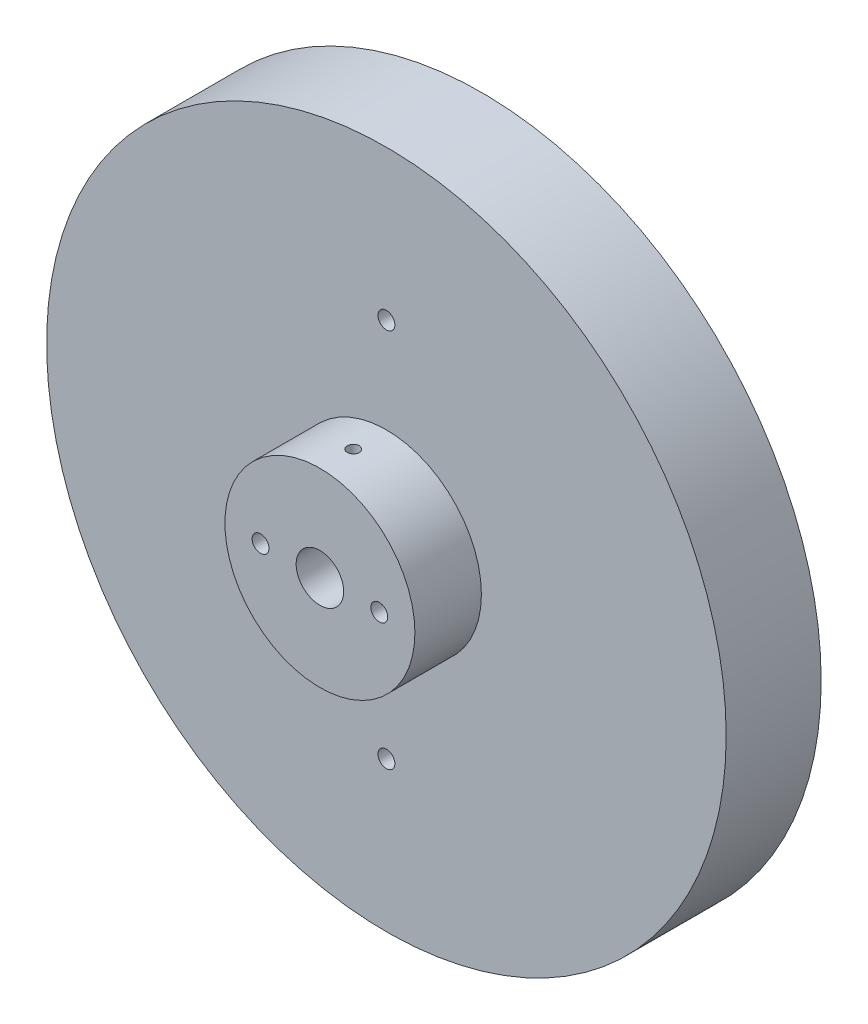
ISO-10303-21;
HEADER;
FILE_DESCRIPTION(('STEP AP214'),'2;1');
FILE_NAME('part.step','',(''),(''),'','','');
FILE_SCHEMA(('AUTOMOTIVE_DESIGN { 1 0 10303 214 1 1 1 1 }'));
ENDSEC;
DATA;
#1=APPLICATION_CONTEXT('core data for automotive mechanical design processes');
#2=APPLICATION_PROTOCOL_DEFINITION('international standard','automotive_design',2000,#1);
#3=PRODUCT_CONTEXT('',#1,'mechanical');
#4=PRODUCT('Part','Part','',(#3));
#5=PRODUCT_RELATED_PRODUCT_CATEGORY('part','',(#4));
#6=PRODUCT_DEFINITION_FORMATION('','',#4);
#7=PRODUCT_DEFINITION_CONTEXT('part definition',#1,'design');
#8=PRODUCT_DEFINITION('design','',#6,#7);
#9=PRODUCT_DEFINITION_SHAPE('','',#8);
#10=(LENGTH_UNIT() NAMED_UNIT(*) SI_UNIT(.MILLI.,.METRE.));
#11=(NAMED_UNIT(*) PLANE_ANGLE_UNIT() SI_UNIT($,.RADIAN.));
#12=(NAMED_UNIT(*) SI_UNIT($,.STERADIAN.) SOLID_ANGLE_UNIT());
#13=UNCERTAINTY_MEASURE_WITH_UNIT(LENGTH_MEASURE(1.E-05),#10,'distance_accuracy_value','');
#14=(GEOMETRIC_REPRESENTATION_CONTEXT(3) GLOBAL_UNCERTAINTY_ASSIGNED_CONTEXT((#13)) GLOBAL_UNIT_ASSIGNED_CONTEXT((#10,
#11,#12)) REPRESENTATION_CONTEXT('',''));
#15=CARTESIAN_POINT('',(0.,0.,0.));
#16=DIRECTION('',(0.,0.,1.));
#17=DIRECTION('',(1.,0.,0.));
#18=AXIS2_PLACEMENT_3D('',#15,#16,#17);
#19=CARTESIAN_POINT('',(0.,0.,12.7));
#20=DIRECTION('',(0.,0.,-1.));
#21=DIRECTION('',(-1.,0.,0.));
#22=AXIS2_PLACEMENT_3D('',#19,#20,#21);
#23=CYLINDRICAL_SURFACE('',#22,45.4279);
#24=CARTESIAN_POINT('',(0.,0.,12.7));
#25=DIRECTION('',(0.,0.,1.));
#26=DIRECTION('',(1.,0.,0.));
#27=AXIS2_PLACEMENT_3D('',#24,#25,#26);
#28=CIRCLE('',#27,45.4279);
#29=CARTESIAN_POINT('',(45.4279,0.,12.7));
#30=VERTEX_POINT('',#29);
#31=EDGE_CURVE('E42',#30,#30,#28,.T.);
#32=ORIENTED_EDGE('',*,*,#31,.F.);
#33=EDGE_LOOP('',(#32));
#34=FACE_BOUND('',#33,.T.);
#35=CARTESIAN_POINT('',(0.,0.,0.));
#36=DIRECTION('',(0.,0.,1.));
#37=DIRECTION('',(1.,0.,0.));
#38=AXIS2_PLACEMENT_3D('',#35,#36,#37);
#39=CIRCLE('',#38,45.4279);
#40=CARTESIAN_POINT('',(45.4279,0.,0.));
#41=VERTEX_POINT('',#40);
#42=EDGE_CURVE('E47',#41,#41,#39,.T.);
#43=ORIENTED_EDGE('',*,*,#42,.T.);
#44=EDGE_LOOP('',(#43));
#45=FACE_BOUND('',#44,.T.);
#46=ADVANCED_FACE('F30',(#34,#45),#23,.T.);
#47=CARTESIAN_POINT('',(0.,0.,12.7));
#48=DIRECTION('',(0.,0.,1.));
#49=DIRECTION('',(1.,0.,0.));
#50=AXIS2_PLACEMENT_3D('',#47,#48,#49);
#51=PLANE('',#50);
#52=CARTESIAN_POINT('',(0.,25.4,12.7));
#53=DIRECTION('',(0.,0.,1.));
#54=DIRECTION('',(1.,0.,0.));
#55=AXIS2_PLACEMENT_3D('',#52,#53,#54);
#56=CIRCLE('',#55,1.1303);
#57=CARTESIAN_POINT('',(1.1303,25.4,12.7));
#58=VERTEX_POINT('',#57);
#59=EDGE_CURVE('E158',#58,#58,#56,.T.);
#60=ORIENTED_EDGE('',*,*,#59,.F.);
#61=EDGE_LOOP('',(#60));
#62=FACE_BOUND('',#61,.T.);
#63=CARTESIAN_POINT('',(0.,-25.4,12.7));
#64=DIRECTION('',(0.,0.,1.));
#65=DIRECTION('',(1.,0.,0.));
#66=AXIS2_PLACEMENT_3D('',#63,#64,#65);
#67=CIRCLE('',#66,1.1303);
#68=CARTESIAN_POINT('',(1.1303,-25.4,12.7));
#69=VERTEX_POINT('',#68);
#70=EDGE_CURVE('E87',#69,#69,#67,.T.);
#71=ORIENTED_EDGE('',*,*,#70,.F.);
#72=EDGE_LOOP('',(#71));
#73=FACE_BOUND('',#72,.T.);
#74=CARTESIAN_POINT('',(0.,0.,12.7));
#75=DIRECTION('',(0.,0.,1.));
#76=DIRECTION('',(1.,0.,0.));
#77=AXIS2_PLACEMENT_3D('',#74,#75,#76);
#78=CIRCLE('',#77,12.7);
#79=CARTESIAN_POINT('',(12.7,0.,12.7));
#80=VERTEX_POINT('',#79);
#81=EDGE_CURVE('E10',#80,#80,#78,.T.);
#82=ORIENTED_EDGE('',*,*,#81,.F.);
#83=EDGE_LOOP('',(#82));
#84=FACE_BOUND('',#83,.T.);
#85=ORIENTED_EDGE('',*,*,#31,.T.);
#86=EDGE_LOOP('',(#85));
#87=FACE_BOUND('',#86,.T.);
#88=ADVANCED_FACE('F100',(#62,#73,#84,#87),#51,.T.);
#89=CARTESIAN_POINT('',(0.,0.,0.));
#90=DIRECTION('',(0.,0.,1.));
#91=DIRECTION('',(1.,0.,0.));
#92=AXIS2_PLACEMENT_3D('',#89,#90,#91);
#93=PLANE('',#92);
#94=CARTESIAN_POINT('',(0.,25.4,0.));
#95=DIRECTION('',(0.,0.,1.));
#96=DIRECTION('',(1.,0.,0.));
#97=AXIS2_PLACEMENT_3D('',#94,#95,#96);
#98=CIRCLE('',#97,1.1303);
#99=CARTESIAN_POINT('',(1.1303,25.4,0.));
#100=VERTEX_POINT('',#99);
#101=EDGE_CURVE('E59',#100,#100,#98,.T.);
#102=ORIENTED_EDGE('',*,*,#101,.T.);
#103=EDGE_LOOP('',(#102));
#104=FACE_BOUND('',#103,.T.);
#105=CARTESIAN_POINT('',(0.,-25.4,0.));
#106=DIRECTION('',(0.,0.,1.));
#107=DIRECTION('',(1.,0.,0.));
#108=AXIS2_PLACEMENT_3D('',#105,#106,#107);
#109=CIRCLE('',#108,1.1303);
#110=CARTESIAN_POINT('',(1.1303,-25.4,0.));
#111=VERTEX_POINT('',#110);
#112=EDGE_CURVE('E159',#111,#111,#109,.T.);
#113=ORIENTED_EDGE('',*,*,#112,.T.);
#114=EDGE_LOOP('',(#113));
#115=FACE_BOUND('',#114,.T.);
#116=CARTESIAN_POINT('',(7.9375,0.,0.));
#117=DIRECTION('',(0.,0.,1.));
#118=DIRECTION('',(1.,0.,0.));
#119=AXIS2_PLACEMENT_3D('',#116,#117,#118);
#120=CIRCLE('',#119,1.1303);
#121=CARTESIAN_POINT('',(9.0678,0.,0.));
#122=VERTEX_POINT('',#121);
#123=EDGE_CURVE('E173',#122,#122,#120,.T.);
#124=ORIENTED_EDGE('',*,*,#123,.T.);
#125=EDGE_LOOP('',(#124));
#126=FACE_BOUND('',#125,.T.);
#127=CARTESIAN_POINT('',(-7.9375,0.,0.));
#128=DIRECTION('',(0.,0.,1.));
#129=DIRECTION('',(1.,0.,0.));
#130=AXIS2_PLACEMENT_3D('',#127,#128,#129);
#131=CIRCLE('',#130,1.1303);
#132=CARTESIAN_POINT('',(-6.8072,0.,0.));
#133=VERTEX_POINT('',#132);
#134=EDGE_CURVE('E177',#133,#133,#131,.T.);
#135=ORIENTED_EDGE('',*,*,#134,.T.);
#136=EDGE_LOOP('',(#135));
#137=FACE_BOUND('',#136,.T.);
#138=CARTESIAN_POINT('',(0.,0.,0.));
#139=DIRECTION('',(0.,0.,1.));
#140=DIRECTION('',(1.,0.,0.));
#141=AXIS2_PLACEMENT_3D('',#138,#139,#140);
#142=CIRCLE('',#141,3.175);
#143=CARTESIAN_POINT('',(3.175,0.,0.));
#144=VERTEX_POINT('',#143);
#145=EDGE_CURVE('E180',#144,#144,#142,.T.);
#146=ORIENTED_EDGE('',*,*,#145,.T.);
#147=EDGE_LOOP('',(#146));
#148=FACE_BOUND('',#147,.T.);
#149=ORIENTED_EDGE('',*,*,#42,.F.);
#150=EDGE_LOOP('',(#149));
#151=FACE_BOUND('',#150,.T.);
#152=ADVANCED_FACE('F98',(#104,#115,#126,#137,#148,#151),#93,.F.);
#153=CARTESIAN_POINT('',(0.,0.,21.59));
#154=DIRECTION('',(0.,0.,-1.));
#155=DIRECTION('',(-1.,0.,0.));
#156=AXIS2_PLACEMENT_3D('',#153,#154,#155);
#157=CYLINDRICAL_SURFACE('',#156,12.7);
#158=CARTESIAN_POINT('',(0.,-12.7,17.93875));
#159=CARTESIAN_POINT('',(0.0445386407758269,-12.6999996702539,17.9387480403016));
#160=CARTESIAN_POINT('',(0.089108467211095,-12.6997632002031,17.9349886967728));
#161=CARTESIAN_POINT('',(0.177017446128859,-12.6988426082153,17.9200458893796));
#162=CARTESIAN_POINT('',(0.22035510492359,-12.6981579652653,17.9088537845104));
#163=CARTESIAN_POINT('',(0.30451365793703,-12.6964184789674,17.8793681727514));
#164=CARTESIAN_POINT('',(0.345335866612445,-12.6953638309289,17.8610784118634));
#165=CARTESIAN_POINT('',(0.423320136899089,-12.6930029528423,17.8179227393988));
#166=CARTESIAN_POINT('',(0.460483034079384,-12.6916967804297,17.793058333881));
#167=CARTESIAN_POINT('',(0.530160094540578,-12.6889774856253,17.7374183667785));
#168=CARTESIAN_POINT('',(0.562668055066121,-12.687564224299,17.70663504373));
#169=CARTESIAN_POINT('',(0.622059418478501,-12.6847912204754,17.6400470576777));
#170=CARTESIAN_POINT('',(0.648942586333779,-12.6834314802164,17.604242184953));
#171=CARTESIAN_POINT('',(0.696340354075598,-12.6809177882767,17.5285923548368));
#172=CARTESIAN_POINT('',(0.716849801975732,-12.6797640033921,17.4887441634927));
#173=CARTESIAN_POINT('',(0.750884974290381,-12.6777941327705,17.4061615122453));
#174=CARTESIAN_POINT('',(0.764410773811094,-12.6769780434017,17.363427083388));
#175=CARTESIAN_POINT('',(0.784077488480055,-12.6757769173313,17.2763447780049));
#176=CARTESIAN_POINT('',(0.790228118980676,-12.6753913135949,17.2319991035465));
#177=CARTESIAN_POINT('',(0.794999892705035,-12.6750929451796,17.1429031989418));
#178=CARTESIAN_POINT('',(0.793621121204831,-12.6751801751455,17.098152973383));
#179=CARTESIAN_POINT('',(0.783381292050813,-12.6758171107668,17.0095844621497));
#180=CARTESIAN_POINT('',(0.774530748068544,-12.6763661665743,16.9657649556167));
#181=CARTESIAN_POINT('',(0.74961491575806,-12.6778638552243,16.8802347679882));
#182=CARTESIAN_POINT('',(0.733549584200964,-12.6788124904609,16.8385240995298));
#183=CARTESIAN_POINT('',(0.694648277426073,-12.6810031805086,16.7583618268452));
#184=CARTESIAN_POINT('',(0.671807532930021,-12.6822454418804,16.7199125429373));
#185=CARTESIAN_POINT('',(0.620007222037515,-12.684883182398,16.6473898419963));
#186=CARTESIAN_POINT('',(0.591047586851629,-12.6862786632663,16.6133164741648));
#187=CARTESIAN_POINT('',(0.527772337502699,-12.689068466804,16.5504516524606));
#188=CARTESIAN_POINT('',(0.493447624305519,-12.6904627833841,16.5216693559599));
#189=CARTESIAN_POINT('',(0.420448470611413,-12.6930908277368,16.4702743364418));
#190=CARTESIAN_POINT('',(0.381774028594806,-12.6943245554532,16.4476616155798));
#191=CARTESIAN_POINT('',(0.301167689969685,-12.6964924973487,16.4092484154907));
#192=CARTESIAN_POINT('',(0.259235627644201,-12.697426696278,16.3934482830919));
#193=CARTESIAN_POINT('',(0.173306827876283,-12.6988901040857,16.3691148854242));
#194=CARTESIAN_POINT('',(0.129310114552844,-12.6994193176937,16.3605815352879));
#195=CARTESIAN_POINT('',(0.0405803715148961,-12.7000125111858,16.3510352798159));
#196=CARTESIAN_POINT('',(-0.00415129103573031,-12.7000772743004,16.3500097135973));
#197=CARTESIAN_POINT('',(-0.0931510123009727,-12.6997363522161,16.35547505714));
#198=CARTESIAN_POINT('',(-0.137419073426951,-12.6993306694653,16.361965927786));
#199=CARTESIAN_POINT('',(-0.224199315938051,-12.6980950296066,16.3822694097697));
#200=CARTESIAN_POINT('',(-0.266712861570951,-12.6972654091209,16.3960762123074));
#201=CARTESIAN_POINT('',(-0.348819375772882,-12.6952752291308,16.4306137334692));
#202=CARTESIAN_POINT('',(-0.388412318069719,-12.6941146666498,16.4513445143686));
#203=CARTESIAN_POINT('',(-0.463611704701287,-12.6915910567067,16.4991737507236));
#204=CARTESIAN_POINT('',(-0.4992127617111,-12.6902277412494,16.526280662036));
#205=CARTESIAN_POINT('',(-0.565363560986746,-12.6874529497527,16.586080385164));
#206=CARTESIAN_POINT('',(-0.595913253511985,-12.6860414732392,16.6187732519779));
#207=CARTESIAN_POINT('',(-0.651137017260602,-12.6833271753912,16.6888714783301));
#208=CARTESIAN_POINT('',(-0.675802874633838,-12.6820245075826,16.7262833155391));
#209=CARTESIAN_POINT('',(-0.718502608340733,-12.6796771747264,16.8047249386905));
#210=CARTESIAN_POINT('',(-0.736536525571194,-12.678632508088,16.8457547023205));
#211=CARTESIAN_POINT('',(-0.765446239525355,-12.6769200942769,16.9302374918798));
#212=CARTESIAN_POINT('',(-0.776327206094562,-12.6762520749295,16.9736887429676));
#213=CARTESIAN_POINT('',(-0.790639032484721,-12.6753675342878,17.0618057420555));
#214=CARTESIAN_POINT('',(-0.794069966247641,-12.6751510085123,17.1064714779973));
#215=CARTESIAN_POINT('',(-0.793383621065992,-12.6751939814164,17.1956678736759));
#216=CARTESIAN_POINT('',(-0.789279255715115,-12.6754526657069,17.2401986337477));
#217=CARTESIAN_POINT('',(-0.773665593152845,-12.6764151826815,17.3279373930398));
#218=CARTESIAN_POINT('',(-0.762156282524843,-12.6771190161721,17.3711453898633));
#219=CARTESIAN_POINT('',(-0.732062340106625,-12.6788923166027,17.4550140619613));
#220=CARTESIAN_POINT('',(-0.713477759125769,-12.6799617809168,17.4956747555262));
#221=CARTESIAN_POINT('',(-0.669762608051094,-12.6823458051446,17.573300428041));
#222=CARTESIAN_POINT('',(-0.644632207515187,-12.6836603587093,17.6102655026851));
#223=CARTESIAN_POINT('',(-0.588491059979675,-12.6863890500341,17.6795161047235));
#224=CARTESIAN_POINT('',(-0.557470981393586,-12.6878033435559,17.7117940606626));
#225=CARTESIAN_POINT('',(-0.490443479553575,-12.6905708218905,17.7706955755633));
#226=CARTESIAN_POINT('',(-0.454434837916005,-12.6919239916675,17.7973177491462));
#227=CARTESIAN_POINT('',(-0.378411362862406,-12.694418147476,17.8441716000475));
#228=CARTESIAN_POINT('',(-0.338391628002222,-12.6955588689172,17.8643953301282));
#229=CARTESIAN_POINT('',(-0.25554662803241,-12.6974960352311,17.8978117224983));
#230=CARTESIAN_POINT('',(-0.212724715084374,-12.6982928831025,17.9110126193615));
#231=CARTESIAN_POINT('',(-0.141367357780981,-12.699243700178,17.9265776249612));
#232=CARTESIAN_POINT('',(-0.11329315964628,-12.6995260521692,17.9311363630951));
#233=CARTESIAN_POINT('',(-0.0568168717581131,-12.6999043071371,17.9372231736441));
#234=CARTESIAN_POINT('',(-0.0284147824580345,-12.7000002103716,17.9387512502493));
#235=CARTESIAN_POINT('',(0.,-12.7,17.93875));
#236=B_SPLINE_CURVE_WITH_KNOTS('',3,(#158,#159,#160,#161,#162,#163,#164,#165,#166,#167,#168,
#169,#170,#171,#172,#173,#174,#175,#176,#177,#178,#179,#180,#181,#182,#183,#184,#185,#186,#187,
#188,#189,#190,#191,#192,#193,#194,#195,#196,#197,#198,#199,#200,#201,#202,#203,#204,#205,#206,
#207,#208,#209,#210,#211,#212,#213,#214,#215,#216,#217,#218,#219,#220,#221,#222,#223,#224,#225,
#226,#227,#228,#229,#230,#231,#232,#233,#234,#235),.UNSPECIFIED.,.T.,.F.,(4,2,2,2,2,2,2,2,2,2,2,
2,2,2,2,2,2,2,2,2,2,2,2,2,2,2,2,2,2,2,2,2,2,2,2,2,2,2,4),(0.,0.133512191491095,
0.267179870793084,0.400777098686803,0.534343749833107,0.668086756061141,0.801835349615526,
0.935691774914923,1.06954676061482,1.20322522398051,1.33690217334166,1.47039133627064,
1.60388129903803,1.73746545055381,1.87105110392134,2.00486582382561,2.13868059048139,
2.27250216883244,2.40632218428552,2.53991647791457,2.67351007632484,2.80699776092145,
2.94048664615583,3.07415356898776,3.20782180795444,3.34167557019411,3.47552850699167,
3.60928459395978,3.74303935338564,3.87656510497391,4.01009109849078,4.14361613314081,
4.27713770940417,4.41087262934118,4.54464026985125,4.67857341112892,4.81234916196738,
4.8975274488601,4.98270561798765),.UNSPECIFIED.);
#237=CARTESIAN_POINT('',(0.,-12.7,17.93875));
#238=VERTEX_POINT('',#237);
#239=EDGE_CURVE('E86',#238,#238,#236,.T.);
#240=ORIENTED_EDGE('',*,*,#239,.T.);
#241=EDGE_LOOP('',(#240));
#242=FACE_BOUND('',#241,.T.);
#243=CARTESIAN_POINT('',(0.,12.7,17.93875));
#244=CARTESIAN_POINT('',(-0.0445386407758269,12.6999996702539,17.9387480403016));
#245=CARTESIAN_POINT('',(-0.089108467211095,12.6997632002031,17.9349886967728));
#246=CARTESIAN_POINT('',(-0.177017446128859,12.6988426082153,17.9200458893796));
#247=CARTESIAN_POINT('',(-0.22035510492359,12.6981579652653,17.9088537845104));
#248=CARTESIAN_POINT('',(-0.30451365793703,12.6964184789674,17.8793681727514));
#249=CARTESIAN_POINT('',(-0.345335866612445,12.6953638309289,17.8610784118634));
#250=CARTESIAN_POINT('',(-0.423320136899089,12.6930029528423,17.8179227393988));
#251=CARTESIAN_POINT('',(-0.460483034079384,12.6916967804297,17.793058333881));
#252=CARTESIAN_POINT('',(-0.530160094540578,12.6889774856253,17.7374183667785));
#253=CARTESIAN_POINT('',(-0.562668055066121,12.687564224299,17.70663504373));
#254=CARTESIAN_POINT('',(-0.622059418478501,12.6847912204754,17.6400470576777));
#255=CARTESIAN_POINT('',(-0.648942586333779,12.6834314802164,17.604242184953));
#256=CARTESIAN_POINT('',(-0.696340354075598,12.6809177882767,17.5285923548368));
#257=CARTESIAN_POINT('',(-0.716849801975732,12.6797640033921,17.4887441634927));
#258=CARTESIAN_POINT('',(-0.750884974290381,12.6777941327705,17.4061615122453));
#259=CARTESIAN_POINT('',(-0.764410773811094,12.6769780434017,17.363427083388));
#260=CARTESIAN_POINT('',(-0.784077488480055,12.6757769173313,17.2763447780049));
#261=CARTESIAN_POINT('',(-0.790228118980676,12.6753913135949,17.2319991035465));
#262=CARTESIAN_POINT('',(-0.794999892705035,12.6750929451796,17.1429031989418));
#263=CARTESIAN_POINT('',(-0.793621121204831,12.6751801751455,17.098152973383));
#264=CARTESIAN_POINT('',(-0.783381292050813,12.6758171107668,17.0095844621497));
#265=CARTESIAN_POINT('',(-0.774530748068544,12.6763661665743,16.9657649556167));
#266=CARTESIAN_POINT('',(-0.74961491575806,12.6778638552243,16.8802347679882));
#267=CARTESIAN_POINT('',(-0.733549584200964,12.6788124904609,16.8385240995298));
#268=CARTESIAN_POINT('',(-0.694648277426073,12.6810031805086,16.7583618268452));
#269=CARTESIAN_POINT('',(-0.671807532930021,12.6822454418804,16.7199125429373));
#270=CARTESIAN_POINT('',(-0.620007222037515,12.684883182398,16.6473898419963));
#271=CARTESIAN_POINT('',(-0.591047586851629,12.6862786632663,16.6133164741648));
#272=CARTESIAN_POINT('',(-0.527772337502699,12.689068466804,16.5504516524606));
#273=CARTESIAN_POINT('',(-0.493447624305519,12.6904627833841,16.5216693559599));
#274=CARTESIAN_POINT('',(-0.420448470611413,12.6930908277368,16.4702743364418));
#275=CARTESIAN_POINT('',(-0.381774028594806,12.6943245554532,16.4476616155798));
#276=CARTESIAN_POINT('',(-0.301167689969685,12.6964924973487,16.4092484154907));
#277=CARTESIAN_POINT('',(-0.259235627644201,12.697426696278,16.3934482830919));
#278=CARTESIAN_POINT('',(-0.173306827876283,12.6988901040857,16.3691148854242));
#279=CARTESIAN_POINT('',(-0.129310114552844,12.6994193176937,16.3605815352879));
#280=CARTESIAN_POINT('',(-0.0405803715148961,12.7000125111858,16.3510352798159));
#281=CARTESIAN_POINT('',(0.00415129103573031,12.7000772743004,16.3500097135973));
#282=CARTESIAN_POINT('',(0.0931510123009727,12.6997363522161,16.35547505714));
#283=CARTESIAN_POINT('',(0.137419073426951,12.6993306694653,16.361965927786));
#284=CARTESIAN_POINT('',(0.224199315938051,12.6980950296066,16.3822694097697));
#285=CARTESIAN_POINT('',(0.266712861570951,12.6972654091209,16.3960762123074));
#286=CARTESIAN_POINT('',(0.348819375772882,12.6952752291308,16.4306137334692));
#287=CARTESIAN_POINT('',(0.388412318069719,12.6941146666498,16.4513445143686));
#288=CARTESIAN_POINT('',(0.463611704701287,12.6915910567067,16.4991737507236));
#289=CARTESIAN_POINT('',(0.4992127617111,12.6902277412494,16.526280662036));
#290=CARTESIAN_POINT('',(0.565363560986746,12.6874529497527,16.586080385164));
#291=CARTESIAN_POINT('',(0.595913253511985,12.6860414732392,16.6187732519779));
#292=CARTESIAN_POINT('',(0.651137017260602,12.6833271753912,16.6888714783301));
#293=CARTESIAN_POINT('',(0.675802874633838,12.6820245075826,16.7262833155391));
#294=CARTESIAN_POINT('',(0.718502608340733,12.6796771747264,16.8047249386905));
#295=CARTESIAN_POINT('',(0.736536525571194,12.678632508088,16.8457547023205));
#296=CARTESIAN_POINT('',(0.765446239525355,12.6769200942769,16.9302374918798));
#297=CARTESIAN_POINT('',(0.776327206094562,12.6762520749295,16.9736887429676));
#298=CARTESIAN_POINT('',(0.790639032484721,12.6753675342878,17.0618057420555));
#299=CARTESIAN_POINT('',(0.794069966247641,12.6751510085123,17.1064714779973));
#300=CARTESIAN_POINT('',(0.793383621065992,12.6751939814164,17.1956678736759));
#301=CARTESIAN_POINT('',(0.789279255715115,12.6754526657069,17.2401986337477));
#302=CARTESIAN_POINT('',(0.773665593152845,12.6764151826815,17.3279373930398));
#303=CARTESIAN_POINT('',(0.762156282524843,12.6771190161721,17.3711453898633));
#304=CARTESIAN_POINT('',(0.732062340106625,12.6788923166027,17.4550140619613));
#305=CARTESIAN_POINT('',(0.713477759125769,12.6799617809168,17.4956747555262));
#306=CARTESIAN_POINT('',(0.669762608051094,12.6823458051446,17.573300428041));
#307=CARTESIAN_POINT('',(0.644632207515187,12.6836603587093,17.6102655026851));
#308=CARTESIAN_POINT('',(0.588491059979675,12.6863890500341,17.6795161047235));
#309=CARTESIAN_POINT('',(0.557470981393586,12.6878033435559,17.7117940606626));
#310=CARTESIAN_POINT('',(0.490443479553575,12.6905708218905,17.7706955755633));
#311=CARTESIAN_POINT('',(0.454434837916005,12.6919239916675,17.7973177491462));
#312=CARTESIAN_POINT('',(0.378411362862406,12.694418147476,17.8441716000475));
#313=CARTESIAN_POINT('',(0.338391628002222,12.6955588689172,17.8643953301282));
#314=CARTESIAN_POINT('',(0.25554662803241,12.6974960352311,17.8978117224983));
#315=CARTESIAN_POINT('',(0.212724715084374,12.6982928831025,17.9110126193615));
#316=CARTESIAN_POINT('',(0.141367357780981,12.699243700178,17.9265776249612));
#317=CARTESIAN_POINT('',(0.11329315964628,12.6995260521692,17.9311363630951));
#318=CARTESIAN_POINT('',(0.0568168717581131,12.6999043071371,17.9372231736441));
#319=CARTESIAN_POINT('',(0.0284147824580345,12.7000002103716,17.9387512502493));
#320=CARTESIAN_POINT('',(0.,12.7,17.93875));
#321=B_SPLINE_CURVE_WITH_KNOTS('',3,(#243,#244,#245,#246,#247,#248,#249,#250,#251,#252,#253,
#254,#255,#256,#257,#258,#259,#260,#261,#262,#263,#264,#265,#266,#267,#268,#269,#270,#271,#272,
#273,#274,#275,#276,#277,#278,#279,#280,#281,#282,#283,#284,#285,#286,#287,#288,#289,#290,#291,
#292,#293,#294,#295,#296,#297,#298,#299,#300,#301,#302,#303,#304,#305,#306,#307,#308,#309,#310,
#311,#312,#313,#314,#315,#316,#317,#318,#319,#320),.UNSPECIFIED.,.T.,.F.,(4,2,2,2,2,2,2,2,2,2,2,
2,2,2,2,2,2,2,2,2,2,2,2,2,2,2,2,2,2,2,2,2,2,2,2,2,2,2,4),(0.,0.133512191491095,
0.267179870793084,0.400777098686803,0.534343749833107,0.668086756061141,0.801835349615526,
0.935691774914923,1.06954676061482,1.20322522398051,1.33690217334166,1.47039133627064,
1.60388129903803,1.73746545055381,1.87105110392134,2.00486582382561,2.13868059048139,
2.27250216883244,2.40632218428552,2.53991647791457,2.67351007632484,2.80699776092145,
2.94048664615583,3.07415356898776,3.20782180795444,3.34167557019411,3.47552850699167,
3.60928459395978,3.74303935338564,3.87656510497391,4.01009109849078,4.14361613314081,
4.27713770940417,4.41087262934118,4.54464026985125,4.67857341112892,4.81234916196738,
4.8975274488601,4.98270561798765),.UNSPECIFIED.);
#322=CARTESIAN_POINT('',(0.,12.7,17.93875));
#323=VERTEX_POINT('',#322);
#324=EDGE_CURVE('E79',#323,#323,#321,.T.);
#325=ORIENTED_EDGE('',*,*,#324,.T.);
#326=EDGE_LOOP('',(#325));
#327=FACE_BOUND('',#326,.T.);
#328=CARTESIAN_POINT('',(0.,0.,21.59));
#329=DIRECTION('',(0.,0.,1.));
#330=DIRECTION('',(1.,0.,0.));
#331=AXIS2_PLACEMENT_3D('',#328,#329,#330);
#332=CIRCLE('',#331,12.7);
#333=CARTESIAN_POINT('',(12.7,0.,21.59));
#334=VERTEX_POINT('',#333);
#335=EDGE_CURVE('E50',#334,#334,#332,.T.);
#336=ORIENTED_EDGE('',*,*,#335,.F.);
#337=EDGE_LOOP('',(#336));
#338=FACE_BOUND('',#337,.T.);
#339=ORIENTED_EDGE('',*,*,#81,.T.);
#340=EDGE_LOOP('',(#339));
#341=FACE_BOUND('',#340,.T.);
#342=ADVANCED_FACE('F93',(#242,#327,#338,#341),#157,.T.);
#343=CARTESIAN_POINT('',(0.,0.,21.59));
#344=DIRECTION('',(0.,0.,1.));
#345=DIRECTION('',(1.,0.,0.));
#346=AXIS2_PLACEMENT_3D('',#343,#344,#345);
#347=PLANE('',#346);
#348=CARTESIAN_POINT('',(7.9375,0.,21.59));
#349=DIRECTION('',(0.,0.,1.));
#350=DIRECTION('',(1.,0.,0.));
#351=AXIS2_PLACEMENT_3D('',#348,#349,#350);
#352=CIRCLE('',#351,1.1303);
#353=CARTESIAN_POINT('',(9.0678,0.,21.59));
#354=VERTEX_POINT('',#353);
#355=EDGE_CURVE('E187',#354,#354,#352,.T.);
#356=ORIENTED_EDGE('',*,*,#355,.F.);
#357=EDGE_LOOP('',(#356));
#358=FACE_BOUND('',#357,.T.);
#359=CARTESIAN_POINT('',(-7.9375,0.,21.59));
#360=DIRECTION('',(0.,0.,1.));
#361=DIRECTION('',(1.,0.,0.));
#362=AXIS2_PLACEMENT_3D('',#359,#360,#361);
#363=CIRCLE('',#362,1.1303);
#364=CARTESIAN_POINT('',(-6.8072,0.,21.59));
#365=VERTEX_POINT('',#364);
#366=EDGE_CURVE('E191',#365,#365,#363,.T.);
#367=ORIENTED_EDGE('',*,*,#366,.F.);
#368=EDGE_LOOP('',(#367));
#369=FACE_BOUND('',#368,.T.);
#370=CARTESIAN_POINT('',(0.,0.,21.59));
#371=DIRECTION('',(0.,0.,1.));
#372=DIRECTION('',(1.,0.,0.));
#373=AXIS2_PLACEMENT_3D('',#370,#371,#372);
#374=CIRCLE('',#373,3.175);
#375=CARTESIAN_POINT('',(3.175,0.,21.59));
#376=VERTEX_POINT('',#375);
#377=EDGE_CURVE('E182',#376,#376,#374,.T.);
#378=ORIENTED_EDGE('',*,*,#377,.F.);
#379=EDGE_LOOP('',(#378));
#380=FACE_BOUND('',#379,.T.);
#381=ORIENTED_EDGE('',*,*,#335,.T.);
#382=EDGE_LOOP('',(#381));
#383=FACE_BOUND('',#382,.T.);
#384=ADVANCED_FACE('F97',(#358,#369,#380,#383),#347,.T.);
#385=CARTESIAN_POINT('',(0.,0.,0.));
#386=DIRECTION('',(0.,0.,1.));
#387=DIRECTION('',(1.,0.,0.));
#388=AXIS2_PLACEMENT_3D('',#385,#386,#387);
#389=CYLINDRICAL_SURFACE('',#388,3.175);
#390=CARTESIAN_POINT('',(0.,-3.175,17.93875));
#391=CARTESIAN_POINT('',(-0.0438552635877327,-3.17499925846823,17.9387487692969));
#392=CARTESIAN_POINT('',(-0.0877242751854455,-3.17408230928092,17.9351032210489));
#393=CARTESIAN_POINT('',(-0.17420501299524,-3.17051326901651,17.9206391907667));
#394=CARTESIAN_POINT('',(-0.216816012302433,-3.167860194514,17.9098166432862));
#395=CARTESIAN_POINT('',(-0.299519378196613,-3.16111268934038,17.8813675617096));
#396=CARTESIAN_POINT('',(-0.339614702315042,-3.15701999003938,17.8637491981798));
#397=CARTESIAN_POINT('',(-0.416280669799425,-3.14782911098185,17.8222373477679));
#398=CARTESIAN_POINT('',(-0.452851194217885,-3.14273089731102,17.7983436492204));
#399=CARTESIAN_POINT('',(-0.522182686530071,-3.13196506358995,17.7444395821413));
#400=CARTESIAN_POINT('',(-0.554860719323984,-3.12628865866099,17.7143242915841));
#401=CARTESIAN_POINT('',(-0.614758807311748,-3.11506457312193,17.649056541569));
#402=CARTESIAN_POINT('',(-0.641978246218917,-3.10951690710918,17.6139035141075));
#403=CARTESIAN_POINT('',(-0.690576545564488,-3.0990898547443,17.5389141925181));
#404=CARTESIAN_POINT('',(-0.711862630927167,-3.09422162074029,17.4990160820295));
#405=CARTESIAN_POINT('',(-0.747393364107986,-3.08583274338135,17.4160664654975));
#406=CARTESIAN_POINT('',(-0.761639137669979,-3.08231188460184,17.3730154648651));
#407=CARTESIAN_POINT('',(-0.782401934475603,-3.07710668929704,17.2858940655345));
#408=CARTESIAN_POINT('',(-0.789068075326391,-3.07538697360746,17.241861367507));
#409=CARTESIAN_POINT('',(-0.794946855973405,-3.07387287676221,17.1532716322301));
#410=CARTESIAN_POINT('',(-0.794160708378679,-3.07407818237407,17.1087146814636));
#411=CARTESIAN_POINT('',(-0.785276202621618,-3.07635912908627,17.0214841350685));
#412=CARTESIAN_POINT('',(-0.777355538350815,-3.07838931671828,16.9787910669747));
#413=CARTESIAN_POINT('',(-0.754710298902892,-3.08401883870473,16.8953597772261));
#414=CARTESIAN_POINT('',(-0.739985239011735,-3.08761828484494,16.8546216950638));
#415=CARTESIAN_POINT('',(-0.70399776540841,-3.09602247774299,16.7757802997333));
#416=CARTESIAN_POINT('',(-0.682670861410748,-3.10083902452569,16.7377077340947));
#417=CARTESIAN_POINT('',(-0.634130196057913,-3.11112805322879,16.665618016087));
#418=CARTESIAN_POINT('',(-0.606915404578012,-3.11660064985464,16.6316015749811));
#419=CARTESIAN_POINT('',(-0.546451062227145,-3.12777653452301,16.5675714200284));
#420=CARTESIAN_POINT('',(-0.513051561612767,-3.1334819509876,16.5376994990092));
#421=CARTESIAN_POINT('',(-0.441648806345706,-3.14433990118774,16.4839537591962));
#422=CARTESIAN_POINT('',(-0.403645411120451,-3.14949241803232,16.4600801236189));
#423=CARTESIAN_POINT('',(-0.323911324427234,-3.15868966566505,16.4189565647896));
#424=CARTESIAN_POINT('',(-0.282168278906227,-3.16273053067588,16.4017296741154));
#425=CARTESIAN_POINT('',(-0.196255220975607,-3.16922106074626,16.3745770923954));
#426=CARTESIAN_POINT('',(-0.152085674550463,-3.17167103017036,16.3646500047287));
#427=CARTESIAN_POINT('',(-0.0637857343313883,-3.17465868364436,16.3525953715584));
#428=CARTESIAN_POINT('',(-0.0196832643270934,-3.17524369981464,16.3502747320352));
#429=CARTESIAN_POINT('',(0.0682798962491322,-3.17457034214314,16.3529692635877));
#430=CARTESIAN_POINT('',(0.112140608228599,-3.1733121342381,16.3579837743145));
#431=CARTESIAN_POINT('',(0.197704217227561,-3.1691240334656,16.3750471056904));
#432=CARTESIAN_POINT('',(0.239429458787633,-3.16621918923325,16.3869905852566));
#433=CARTESIAN_POINT('',(0.320281983922788,-3.15906523927229,16.4174524986317));
#434=CARTESIAN_POINT('',(0.359409004654769,-3.15481599779068,16.4359715964491));
#435=CARTESIAN_POINT('',(0.434722658635794,-3.14533125444339,16.4794332848629));
#436=CARTESIAN_POINT('',(0.470844796304794,-3.14007958981668,16.5044840261433));
#437=CARTESIAN_POINT('',(0.538441166386219,-3.12919802778343,16.5601596600717));
#438=CARTESIAN_POINT('',(0.56991459495655,-3.12356806520694,16.590785514714));
#439=CARTESIAN_POINT('',(0.62811584227182,-3.11239406391741,16.6576385376135));
#440=CARTESIAN_POINT('',(0.654708213283326,-3.10685552632436,16.6939847428388));
#441=CARTESIAN_POINT('',(0.701416109977552,-3.09664564807955,16.7707376857381));
#442=CARTESIAN_POINT('',(0.721531923158574,-3.09197426893801,16.8111442430662));
#443=CARTESIAN_POINT('',(0.754565960072416,-3.0840790846376,16.8946542781103));
#444=CARTESIAN_POINT('',(0.767526826562776,-3.08084672591967,16.9377400366654));
#445=CARTESIAN_POINT('',(0.785995411725541,-3.07618735414389,17.025572183383));
#446=CARTESIAN_POINT('',(0.791504760374122,-3.074759946268,17.0703182061714));
#447=CARTESIAN_POINT('',(0.794828754051738,-3.0739021855376,17.1588223751234));
#448=CARTESIAN_POINT('',(0.792859887575312,-3.07441564402039,17.2025719760868));
#449=CARTESIAN_POINT('',(0.781778809773891,-3.07725185183317,17.2890941410868));
#450=CARTESIAN_POINT('',(0.77266674200508,-3.07957456480274,17.3318667247406));
#451=CARTESIAN_POINT('',(0.747676156538477,-3.08573625444607,17.4149853095888));
#452=CARTESIAN_POINT('',(0.73183824331003,-3.08956612229214,17.4553442406896));
#453=CARTESIAN_POINT('',(0.693877683449348,-3.09831187404388,17.5328608483527));
#454=CARTESIAN_POINT('',(0.671754165143089,-3.10322790855576,17.5700180799781));
#455=CARTESIAN_POINT('',(0.621171683653815,-3.11375231464442,17.6411226578469));
#456=CARTESIAN_POINT('',(0.592562507041065,-3.11937540140138,17.6749609846868));
#457=CARTESIAN_POINT('',(0.530113542254565,-3.1305924775116,17.7374269778709));
#458=CARTESIAN_POINT('',(0.496272513750686,-3.13618645963902,17.7660534051014));
#459=CARTESIAN_POINT('',(0.423580764630117,-3.14683592780222,17.8177884841154));
#460=CARTESIAN_POINT('',(0.384650415142419,-3.15187982656105,17.8407878164012));
#461=CARTESIAN_POINT('',(0.303353289824291,-3.16073856132667,17.879878865806));
#462=CARTESIAN_POINT('',(0.260989002318606,-3.16455427751551,17.8959755325099));
#463=CARTESIAN_POINT('',(0.182250425674669,-3.16996264853432,17.9184150935494));
#464=CARTESIAN_POINT('',(0.146251173772185,-3.17183867923715,17.9260241994491));
#465=CARTESIAN_POINT('',(0.0735044628546159,-3.17435761935239,17.9361919784999));
#466=CARTESIAN_POINT('',(0.0367570603242175,-3.17500062151098,17.9387510315074));
#467=CARTESIAN_POINT('',(0.,-3.175,17.93875));
#468=B_SPLINE_CURVE_WITH_KNOTS('',3,(#390,#391,#392,#393,#394,#395,#396,#397,#398,#399,#400,
#401,#402,#403,#404,#405,#406,#407,#408,#409,#410,#411,#412,#413,#414,#415,#416,#417,#418,#419,
#420,#421,#422,#423,#424,#425,#426,#427,#428,#429,#430,#431,#432,#433,#434,#435,#436,#437,#438,
#439,#440,#441,#442,#443,#444,#445,#446,#447,#448,#449,#450,#451,#452,#453,#454,#455,#456,#457,
#458,#459,#460,#461,#462,#463,#464,#465,#466,#467),.UNSPECIFIED.,.T.,.F.,(4,2,2,2,2,2,2,2,2,2,2,
2,2,2,2,2,2,2,2,2,2,2,2,2,2,2,2,2,2,2,2,2,2,2,2,2,2,2,4),(0.,0.131431089516375,
0.262936692483397,0.39428467745973,0.525637093339603,0.659418054188196,0.793214110694495,
0.928997843263226,1.06475985702124,1.19780206156782,1.33082261834636,1.46061904666214,
1.59042472250778,1.72154070999928,1.85267965567469,1.98755794262773,2.12244034891239,
2.25778604517323,2.39310583993573,2.52496271818992,2.6568077267216,2.78669895263678,
2.91660329874712,3.04881273419999,3.18104500425076,3.31652302787369,3.45199503671614,
3.58665068066594,3.72127686471066,3.85203583794266,3.98279218339235,4.11277011962707,
4.24276608972444,4.37615317516911,4.50957193170179,4.64540698160198,4.78114446688797,
4.89131103556887,5.00146931739441),.UNSPECIFIED.);
#469=CARTESIAN_POINT('',(0.,-3.175,17.93875));
#470=VERTEX_POINT('',#469);
#471=EDGE_CURVE('E33',#470,#470,#468,.T.);
#472=ORIENTED_EDGE('',*,*,#471,.T.);
#473=EDGE_LOOP('',(#472));
#474=FACE_BOUND('',#473,.T.);
#475=CARTESIAN_POINT('',(0.,3.175,17.93875));
#476=CARTESIAN_POINT('',(0.0438552635877327,3.17499925846823,17.9387487692969));
#477=CARTESIAN_POINT('',(0.0877242751854455,3.17408230928092,17.9351032210489));
#478=CARTESIAN_POINT('',(0.17420501299524,3.17051326901651,17.9206391907667));
#479=CARTESIAN_POINT('',(0.216816012302433,3.167860194514,17.9098166432862));
#480=CARTESIAN_POINT('',(0.299519378196613,3.16111268934038,17.8813675617096));
#481=CARTESIAN_POINT('',(0.339614702315042,3.15701999003938,17.8637491981798));
#482=CARTESIAN_POINT('',(0.416280669799425,3.14782911098185,17.8222373477679));
#483=CARTESIAN_POINT('',(0.452851194217885,3.14273089731102,17.7983436492204));
#484=CARTESIAN_POINT('',(0.522182686530071,3.13196506358995,17.7444395821413));
#485=CARTESIAN_POINT('',(0.554860719323984,3.12628865866099,17.7143242915841));
#486=CARTESIAN_POINT('',(0.614758807311748,3.11506457312193,17.649056541569));
#487=CARTESIAN_POINT('',(0.641978246218917,3.10951690710918,17.6139035141075));
#488=CARTESIAN_POINT('',(0.690576545564488,3.0990898547443,17.5389141925181));
#489=CARTESIAN_POINT('',(0.711862630927167,3.09422162074029,17.4990160820295));
#490=CARTESIAN_POINT('',(0.747393364107986,3.08583274338135,17.4160664654975));
#491=CARTESIAN_POINT('',(0.761639137669979,3.08231188460184,17.3730154648651));
#492=CARTESIAN_POINT('',(0.782401934475603,3.07710668929704,17.2858940655345));
#493=CARTESIAN_POINT('',(0.789068075326391,3.07538697360746,17.241861367507));
#494=CARTESIAN_POINT('',(0.794946855973405,3.07387287676221,17.1532716322301));
#495=CARTESIAN_POINT('',(0.794160708378679,3.07407818237407,17.1087146814636));
#496=CARTESIAN_POINT('',(0.785276202621618,3.07635912908627,17.0214841350685));
#497=CARTESIAN_POINT('',(0.777355538350815,3.07838931671828,16.9787910669747));
#498=CARTESIAN_POINT('',(0.754710298902892,3.08401883870473,16.8953597772261));
#499=CARTESIAN_POINT('',(0.739985239011735,3.08761828484494,16.8546216950638));
#500=CARTESIAN_POINT('',(0.70399776540841,3.09602247774299,16.7757802997333));
#501=CARTESIAN_POINT('',(0.682670861410748,3.10083902452569,16.7377077340947));
#502=CARTESIAN_POINT('',(0.634130196057913,3.11112805322879,16.665618016087));
#503=CARTESIAN_POINT('',(0.606915404578012,3.11660064985464,16.6316015749811));
#504=CARTESIAN_POINT('',(0.546451062227145,3.12777653452301,16.5675714200284));
#505=CARTESIAN_POINT('',(0.513051561612767,3.1334819509876,16.5376994990092));
#506=CARTESIAN_POINT('',(0.441648806345706,3.14433990118774,16.4839537591962));
#507=CARTESIAN_POINT('',(0.403645411120451,3.14949241803232,16.4600801236189));
#508=CARTESIAN_POINT('',(0.323911324427234,3.15868966566505,16.4189565647896));
#509=CARTESIAN_POINT('',(0.282168278906227,3.16273053067588,16.4017296741154));
#510=CARTESIAN_POINT('',(0.196255220975607,3.16922106074626,16.3745770923954));
#511=CARTESIAN_POINT('',(0.152085674550463,3.17167103017036,16.3646500047287));
#512=CARTESIAN_POINT('',(0.0637857343313883,3.17465868364436,16.3525953715584));
#513=CARTESIAN_POINT('',(0.0196832643270934,3.17524369981464,16.3502747320352));
#514=CARTESIAN_POINT('',(-0.0682798962491322,3.17457034214314,16.3529692635877));
#515=CARTESIAN_POINT('',(-0.112140608228599,3.1733121342381,16.3579837743145));
#516=CARTESIAN_POINT('',(-0.197704217227561,3.1691240334656,16.3750471056904));
#517=CARTESIAN_POINT('',(-0.239429458787633,3.16621918923325,16.3869905852566));
#518=CARTESIAN_POINT('',(-0.320281983922788,3.15906523927229,16.4174524986317));
#519=CARTESIAN_POINT('',(-0.359409004654769,3.15481599779068,16.4359715964491));
#520=CARTESIAN_POINT('',(-0.434722658635794,3.14533125444339,16.4794332848629));
#521=CARTESIAN_POINT('',(-0.470844796304794,3.14007958981668,16.5044840261433));
#522=CARTESIAN_POINT('',(-0.538441166386219,3.12919802778343,16.5601596600717));
#523=CARTESIAN_POINT('',(-0.56991459495655,3.12356806520694,16.590785514714));
#524=CARTESIAN_POINT('',(-0.62811584227182,3.11239406391741,16.6576385376135));
#525=CARTESIAN_POINT('',(-0.654708213283326,3.10685552632436,16.6939847428388));
#526=CARTESIAN_POINT('',(-0.701416109977552,3.09664564807955,16.7707376857381));
#527=CARTESIAN_POINT('',(-0.721531923158574,3.09197426893801,16.8111442430662));
#528=CARTESIAN_POINT('',(-0.754565960072416,3.0840790846376,16.8946542781103));
#529=CARTESIAN_POINT('',(-0.767526826562776,3.08084672591967,16.9377400366654));
#530=CARTESIAN_POINT('',(-0.785995411725541,3.07618735414389,17.025572183383));
#531=CARTESIAN_POINT('',(-0.791504760374122,3.074759946268,17.0703182061714));
#532=CARTESIAN_POINT('',(-0.794828754051738,3.0739021855376,17.1588223751234));
#533=CARTESIAN_POINT('',(-0.792859887575312,3.07441564402039,17.2025719760868));
#534=CARTESIAN_POINT('',(-0.781778809773891,3.07725185183317,17.2890941410868));
#535=CARTESIAN_POINT('',(-0.77266674200508,3.07957456480274,17.3318667247406));
#536=CARTESIAN_POINT('',(-0.747676156538477,3.08573625444607,17.4149853095888));
#537=CARTESIAN_POINT('',(-0.73183824331003,3.08956612229214,17.4553442406896));
#538=CARTESIAN_POINT('',(-0.693877683449348,3.09831187404388,17.5328608483527));
#539=CARTESIAN_POINT('',(-0.671754165143089,3.10322790855576,17.5700180799781));
#540=CARTESIAN_POINT('',(-0.621171683653815,3.11375231464442,17.6411226578469));
#541=CARTESIAN_POINT('',(-0.592562507041065,3.11937540140138,17.6749609846868));
#542=CARTESIAN_POINT('',(-0.530113542254565,3.1305924775116,17.7374269778709));
#543=CARTESIAN_POINT('',(-0.496272513750686,3.13618645963902,17.7660534051014));
#544=CARTESIAN_POINT('',(-0.423580764630117,3.14683592780222,17.8177884841154));
#545=CARTESIAN_POINT('',(-0.384650415142419,3.15187982656105,17.8407878164012));
#546=CARTESIAN_POINT('',(-0.303353289824291,3.16073856132667,17.879878865806));
#547=CARTESIAN_POINT('',(-0.260989002318606,3.16455427751551,17.8959755325099));
#548=CARTESIAN_POINT('',(-0.182250425674669,3.16996264853432,17.9184150935494));
#549=CARTESIAN_POINT('',(-0.146251173772185,3.17183867923715,17.9260241994491));
#550=CARTESIAN_POINT('',(-0.0735044628546159,3.17435761935239,17.9361919784999));
#551=CARTESIAN_POINT('',(-0.0367570603242175,3.17500062151098,17.9387510315074));
#552=CARTESIAN_POINT('',(0.,3.175,17.93875));
#553=B_SPLINE_CURVE_WITH_KNOTS('',3,(#475,#476,#477,#478,#479,#480,#481,#482,#483,#484,#485,
#486,#487,#488,#489,#490,#491,#492,#493,#494,#495,#496,#497,#498,#499,#500,#501,#502,#503,#504,
#505,#506,#507,#508,#509,#510,#511,#512,#513,#514,#515,#516,#517,#518,#519,#520,#521,#522,#523,
#524,#525,#526,#527,#528,#529,#530,#531,#532,#533,#534,#535,#536,#537,#538,#539,#540,#541,#542,
#543,#544,#545,#546,#547,#548,#549,#550,#551,#552),.UNSPECIFIED.,.T.,.F.,(4,2,2,2,2,2,2,2,2,2,2,
2,2,2,2,2,2,2,2,2,2,2,2,2,2,2,2,2,2,2,2,2,2,2,2,2,2,2,4),(0.,0.131431089516375,
0.262936692483397,0.39428467745973,0.525637093339603,0.659418054188196,0.793214110694495,
0.928997843263226,1.06475985702124,1.19780206156782,1.33082261834636,1.46061904666214,
1.59042472250778,1.72154070999928,1.85267965567469,1.98755794262773,2.12244034891239,
2.25778604517323,2.39310583993573,2.52496271818992,2.6568077267216,2.78669895263678,
2.91660329874712,3.04881273419999,3.18104500425076,3.31652302787369,3.45199503671614,
3.58665068066594,3.72127686471066,3.85203583794266,3.98279218339235,4.11277011962707,
4.24276608972444,4.37615317516911,4.50957193170179,4.64540698160198,4.78114446688797,
4.89131103556887,5.00146931739441),.UNSPECIFIED.);
#554=CARTESIAN_POINT('',(0.,3.175,17.93875));
#555=VERTEX_POINT('',#554);
#556=EDGE_CURVE('E54',#555,#555,#553,.T.);
#557=ORIENTED_EDGE('',*,*,#556,.T.);
#558=EDGE_LOOP('',(#557));
#559=FACE_BOUND('',#558,.T.);
#560=ORIENTED_EDGE('',*,*,#145,.F.);
#561=EDGE_LOOP('',(#560));
#562=FACE_BOUND('',#561,.T.);
#563=ORIENTED_EDGE('',*,*,#377,.T.);
#564=EDGE_LOOP('',(#563));
#565=FACE_BOUND('',#564,.T.);
#566=ADVANCED_FACE('F60',(#474,#559,#562,#565),#389,.F.);
#567=CARTESIAN_POINT('',(-7.9375,0.,0.));
#568=DIRECTION('',(0.,0.,1.));
#569=DIRECTION('',(1.,0.,0.));
#570=AXIS2_PLACEMENT_3D('',#567,#568,#569);
#571=CYLINDRICAL_SURFACE('',#570,1.1303);
#572=ORIENTED_EDGE('',*,*,#134,.F.);
#573=EDGE_LOOP('',(#572));
#574=FACE_BOUND('',#573,.T.);
#575=ORIENTED_EDGE('',*,*,#366,.T.);
#576=EDGE_LOOP('',(#575));
#577=FACE_BOUND('',#576,.T.);
#578=ADVANCED_FACE('F73',(#574,#577),#571,.F.);
#579=CARTESIAN_POINT('',(7.9375,0.,0.));
#580=DIRECTION('',(0.,0.,1.));
#581=DIRECTION('',(1.,0.,0.));
#582=AXIS2_PLACEMENT_3D('',#579,#580,#581);
#583=CYLINDRICAL_SURFACE('',#582,1.1303);
#584=ORIENTED_EDGE('',*,*,#123,.F.);
#585=EDGE_LOOP('',(#584));
#586=FACE_BOUND('',#585,.T.);
#587=ORIENTED_EDGE('',*,*,#355,.T.);
#588=EDGE_LOOP('',(#587));
#589=FACE_BOUND('',#588,.T.);
#590=ADVANCED_FACE('F209',(#586,#589),#583,.F.);
#591=CARTESIAN_POINT('',(0.,-45.4279,17.145));
#592=DIRECTION('',(0.,1.,0.));
#593=DIRECTION('',(0.,0.,1.));
#594=AXIS2_PLACEMENT_3D('',#591,#592,#593);
#595=CYLINDRICAL_SURFACE('',#594,0.793749999999999);
#596=ORIENTED_EDGE('',*,*,#556,.F.);
#597=EDGE_LOOP('',(#596));
#598=FACE_BOUND('',#597,.T.);
#599=ORIENTED_EDGE('',*,*,#324,.F.);
#600=EDGE_LOOP('',(#599));
#601=FACE_BOUND('',#600,.T.);
#602=ADVANCED_FACE('F70',(#598,#601),#595,.F.);
#603=ORIENTED_EDGE('',*,*,#471,.F.);
#604=EDGE_LOOP('',(#603));
#605=FACE_BOUND('',#604,.T.);
#606=ORIENTED_EDGE('',*,*,#239,.F.);
#607=EDGE_LOOP('',(#606));
#608=FACE_BOUND('',#607,.T.);
#609=ADVANCED_FACE('F64',(#605,#608),#595,.F.);
#610=CARTESIAN_POINT('',(0.,-25.4,0.));
#611=DIRECTION('',(0.,0.,1.));
#612=DIRECTION('',(1.,0.,0.));
#613=AXIS2_PLACEMENT_3D('',#610,#611,#612);
#614=CYLINDRICAL_SURFACE('',#613,1.1303);
#615=ORIENTED_EDGE('',*,*,#112,.F.);
#616=EDGE_LOOP('',(#615));
#617=FACE_BOUND('',#616,.T.);
#618=ORIENTED_EDGE('',*,*,#70,.T.);
#619=EDGE_LOOP('',(#618));
#620=FACE_BOUND('',#619,.T.);
#621=ADVANCED_FACE('F69',(#617,#620),#614,.F.);
#622=CARTESIAN_POINT('',(0.,25.4,0.));
#623=DIRECTION('',(0.,0.,1.));
#624=DIRECTION('',(1.,0.,0.));
#625=AXIS2_PLACEMENT_3D('',#622,#623,#624);
#626=CYLINDRICAL_SURFACE('',#625,1.1303);
#627=ORIENTED_EDGE('',*,*,#101,.F.);
#628=EDGE_LOOP('',(#627));
#629=FACE_BOUND('',#628,.T.);
#630=ORIENTED_EDGE('',*,*,#59,.T.);
#631=EDGE_LOOP('',(#630));
#632=FACE_BOUND('',#631,.T.);
#633=ADVANCED_FACE('F142',(#629,#632),#626,.F.);
#634=CLOSED_SHELL('',(#46,#88,#152,#342,#384,#566,#578,#590,#602,#609,#621,#633));
#635=MANIFOLD_SOLID_BREP('B2',#634);
#636=ADVANCED_BREP_SHAPE_REPRESENTATION('',(#18,#635),#14);
#637=SHAPE_DEFINITION_REPRESENTATION(#9,#636);
ENDSEC;
END-ISO-10303-21;
